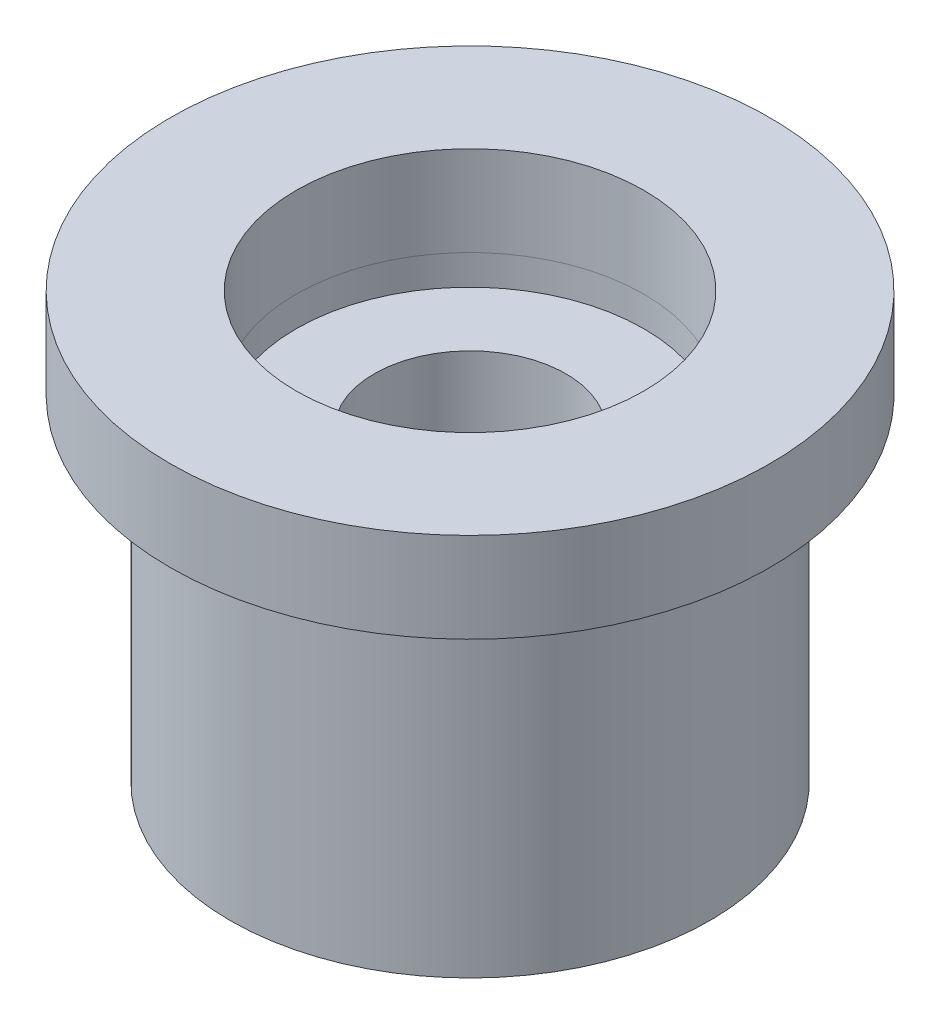
ISO-10303-21;
HEADER;
FILE_DESCRIPTION(('STEP AP214'),'2;1');
FILE_NAME('part.step','',(''),(''),'','','');
FILE_SCHEMA(('AUTOMOTIVE_DESIGN { 1 0 10303 214 1 1 1 1 }'));
ENDSEC;
DATA;
#1=APPLICATION_CONTEXT('core data for automotive mechanical design processes');
#2=APPLICATION_PROTOCOL_DEFINITION('international standard','automotive_design',2000,#1);
#3=PRODUCT_CONTEXT('',#1,'mechanical');
#4=PRODUCT('Part','Part','',(#3));
#5=PRODUCT_RELATED_PRODUCT_CATEGORY('part','',(#4));
#6=PRODUCT_DEFINITION_FORMATION('','',#4);
#7=PRODUCT_DEFINITION_CONTEXT('part definition',#1,'design');
#8=PRODUCT_DEFINITION('design','',#6,#7);
#9=PRODUCT_DEFINITION_SHAPE('','',#8);
#10=(LENGTH_UNIT() NAMED_UNIT(*) SI_UNIT(.MILLI.,.METRE.));
#11=(NAMED_UNIT(*) PLANE_ANGLE_UNIT() SI_UNIT($,.RADIAN.));
#12=(NAMED_UNIT(*) SI_UNIT($,.STERADIAN.) SOLID_ANGLE_UNIT());
#13=UNCERTAINTY_MEASURE_WITH_UNIT(LENGTH_MEASURE(1.E-05),#10,'distance_accuracy_value','');
#14=(GEOMETRIC_REPRESENTATION_CONTEXT(3) GLOBAL_UNCERTAINTY_ASSIGNED_CONTEXT((#13)) GLOBAL_UNIT_ASSIGNED_CONTEXT((#10,
#11,#12)) REPRESENTATION_CONTEXT('',''));
#15=CARTESIAN_POINT('',(0.,0.,0.));
#16=DIRECTION('',(0.,0.,1.));
#17=DIRECTION('',(1.,0.,0.));
#18=AXIS2_PLACEMENT_3D('',#15,#16,#17);
#19=CARTESIAN_POINT('',(0.,7.1,0.));
#20=DIRECTION('',(0.,-1.,0.));
#21=DIRECTION('',(0.,0.,-1.));
#22=AXIS2_PLACEMENT_3D('',#19,#20,#21);
#23=CYLINDRICAL_SURFACE('',#22,5.);
#24=CARTESIAN_POINT('',(0.,7.1,0.));
#25=DIRECTION('',(0.,1.,0.));
#26=DIRECTION('',(0.,0.,1.));
#27=AXIS2_PLACEMENT_3D('',#24,#25,#26);
#28=CIRCLE('',#27,5.);
#29=CARTESIAN_POINT('',(0.,7.1,5.));
#30=VERTEX_POINT('',#29);
#31=EDGE_CURVE('E11',#30,#30,#28,.T.);
#32=ORIENTED_EDGE('',*,*,#31,.F.);
#33=EDGE_LOOP('',(#32));
#34=FACE_BOUND('',#33,.T.);
#35=CARTESIAN_POINT('',(0.,5.6,0.));
#36=DIRECTION('',(0.,1.,0.));
#37=DIRECTION('',(0.,0.,1.));
#38=AXIS2_PLACEMENT_3D('',#35,#36,#37);
#39=CIRCLE('',#38,5.);
#40=CARTESIAN_POINT('',(0.,5.6,5.));
#41=VERTEX_POINT('',#40);
#42=EDGE_CURVE('E50',#41,#41,#39,.T.);
#43=ORIENTED_EDGE('',*,*,#42,.T.);
#44=EDGE_LOOP('',(#43));
#45=FACE_BOUND('',#44,.T.);
#46=ADVANCED_FACE('F43',(#34,#45),#23,.T.);
#47=CARTESIAN_POINT('',(0.,7.1,0.));
#48=DIRECTION('',(0.,1.,0.));
#49=DIRECTION('',(0.,0.,1.));
#50=AXIS2_PLACEMENT_3D('',#47,#48,#49);
#51=PLANE('',#50);
#52=CARTESIAN_POINT('',(0.,7.1,0.));
#53=DIRECTION('',(0.,1.,0.));
#54=DIRECTION('',(0.,0.,1.));
#55=AXIS2_PLACEMENT_3D('',#52,#53,#54);
#56=CIRCLE('',#55,2.9);
#57=CARTESIAN_POINT('',(0.,7.1,2.9));
#58=VERTEX_POINT('',#57);
#59=EDGE_CURVE('E56',#58,#58,#56,.T.);
#60=ORIENTED_EDGE('',*,*,#59,.F.);
#61=EDGE_LOOP('',(#60));
#62=FACE_BOUND('',#61,.T.);
#63=ORIENTED_EDGE('',*,*,#31,.T.);
#64=EDGE_LOOP('',(#63));
#65=FACE_BOUND('',#64,.T.);
#66=ADVANCED_FACE('F72',(#62,#65),#51,.T.);
#67=CARTESIAN_POINT('',(0.,5.6,0.));
#68=DIRECTION('',(0.,1.,0.));
#69=DIRECTION('',(0.,0.,1.));
#70=AXIS2_PLACEMENT_3D('',#67,#68,#69);
#71=PLANE('',#70);
#72=CARTESIAN_POINT('',(0.,5.6,0.));
#73=DIRECTION('',(0.,1.,0.));
#74=DIRECTION('',(0.,0.,1.));
#75=AXIS2_PLACEMENT_3D('',#72,#73,#74);
#76=CIRCLE('',#75,2.9);
#77=CARTESIAN_POINT('',(0.,5.6,2.9));
#78=VERTEX_POINT('',#77);
#79=EDGE_CURVE('E46',#78,#78,#76,.T.);
#80=ORIENTED_EDGE('',*,*,#79,.T.);
#81=EDGE_LOOP('',(#80));
#82=FACE_BOUND('',#81,.T.);
#83=ORIENTED_EDGE('',*,*,#42,.F.);
#84=EDGE_LOOP('',(#83));
#85=FACE_BOUND('',#84,.T.);
#86=ADVANCED_FACE('F63',(#82,#85),#71,.F.);
#87=CARTESIAN_POINT('',(0.,5.1,0.));
#88=DIRECTION('',(0.,1.,0.));
#89=DIRECTION('',(0.,0.,1.));
#90=AXIS2_PLACEMENT_3D('',#87,#88,#89);
#91=CYLINDRICAL_SURFACE('',#90,2.9);
#92=ORIENTED_EDGE('',*,*,#59,.T.);
#93=EDGE_LOOP('',(#92));
#94=FACE_BOUND('',#93,.T.);
#95=ORIENTED_EDGE('',*,*,#79,.F.);
#96=EDGE_LOOP('',(#95));
#97=FACE_BOUND('',#96,.T.);
#98=ADVANCED_FACE('F66',(#94,#97),#91,.F.);
#99=CLOSED_SHELL('',(#46,#66,#86,#98));
#100=MANIFOLD_SOLID_BREP('B2',#99);
#101=CARTESIAN_POINT('',(0.,5.6,0.));
#102=DIRECTION('',(0.,-1.,0.));
#103=DIRECTION('',(0.,0.,-1.));
#104=AXIS2_PLACEMENT_3D('',#101,#102,#103);
#105=CYLINDRICAL_SURFACE('',#104,4.);
#106=CARTESIAN_POINT('',(0.,5.6,0.));
#107=DIRECTION('',(0.,1.,0.));
#108=DIRECTION('',(0.,0.,1.));
#109=AXIS2_PLACEMENT_3D('',#106,#107,#108);
#110=CIRCLE('',#109,4.);
#111=CARTESIAN_POINT('',(0.,5.6,4.));
#112=VERTEX_POINT('',#111);
#113=EDGE_CURVE('E41',#112,#112,#110,.T.);
#114=ORIENTED_EDGE('',*,*,#113,.F.);
#115=EDGE_LOOP('',(#114));
#116=FACE_BOUND('',#115,.T.);
#117=CARTESIAN_POINT('',(0.,0.,0.));
#118=DIRECTION('',(0.,1.,0.));
#119=DIRECTION('',(0.,0.,1.));
#120=AXIS2_PLACEMENT_3D('',#117,#118,#119);
#121=CIRCLE('',#120,4.);
#122=CARTESIAN_POINT('',(0.,0.,4.));
#123=VERTEX_POINT('',#122);
#124=EDGE_CURVE('E113',#123,#123,#121,.T.);
#125=ORIENTED_EDGE('',*,*,#124,.T.);
#126=EDGE_LOOP('',(#125));
#127=FACE_BOUND('',#126,.T.);
#128=ADVANCED_FACE('F105',(#116,#127),#105,.T.);
#129=CARTESIAN_POINT('',(0.,5.6,0.));
#130=DIRECTION('',(0.,1.,0.));
#131=DIRECTION('',(0.,0.,1.));
#132=AXIS2_PLACEMENT_3D('',#129,#130,#131);
#133=PLANE('',#132);
#134=CARTESIAN_POINT('',(0.,5.6,0.));
#135=DIRECTION('',(0.,1.,0.));
#136=DIRECTION('',(0.,0.,1.));
#137=AXIS2_PLACEMENT_3D('',#134,#135,#136);
#138=CIRCLE('',#137,2.9);
#139=CARTESIAN_POINT('',(0.,5.6,2.9));
#140=VERTEX_POINT('',#139);
#141=EDGE_CURVE('E108',#140,#140,#138,.T.);
#142=ORIENTED_EDGE('',*,*,#141,.F.);
#143=EDGE_LOOP('',(#142));
#144=FACE_BOUND('',#143,.T.);
#145=ORIENTED_EDGE('',*,*,#113,.T.);
#146=EDGE_LOOP('',(#145));
#147=FACE_BOUND('',#146,.T.);
#148=ADVANCED_FACE('F312',(#144,#147),#133,.T.);
#149=CARTESIAN_POINT('',(0.,0.,0.));
#150=DIRECTION('',(0.,1.,0.));
#151=DIRECTION('',(0.,0.,1.));
#152=AXIS2_PLACEMENT_3D('',#149,#150,#151);
#153=PLANE('',#152);
#154=DIRECTION('',(0.499999999999992,0.,-0.866025403784443));
#155=VECTOR('',#154,1.);
#156=CARTESIAN_POINT('',(-0.786065003776817,0.,2.16150452459331));
#157=LINE('',#156,#155);
#158=CARTESIAN_POINT('',(-1.19063245338014,0.,2.86223590239484));
#159=VERTEX_POINT('',#158);
#160=CARTESIAN_POINT('',(-0.786065003776817,0.,2.16150452459331));
#161=VERTEX_POINT('',#160);
#162=EDGE_CURVE('E224',#159,#161,#157,.T.);
#163=ORIENTED_EDGE('',*,*,#162,.F.);
#164=CARTESIAN_POINT('',(0.,0.,0.));
#165=DIRECTION('',(0.,-1.,0.));
#166=DIRECTION('',(0.,0.,-1.));
#167=AXIS2_PLACEMENT_3D('',#164,#165,#166);
#168=CIRCLE('',#167,3.1);
#169=CARTESIAN_POINT('',(3.07408522978788,0.,0.4));
#170=VERTEX_POINT('',#169);
#171=EDGE_CURVE('E121',#170,#159,#168,.T.);
#172=ORIENTED_EDGE('',*,*,#171,.F.);
#173=DIRECTION('',(1.,0.,0.));
#174=VECTOR('',#173,1.);
#175=CARTESIAN_POINT('',(2.26495033058123,0.,0.4));
#176=LINE('',#175,#174);
#177=CARTESIAN_POINT('',(2.26495033058123,0.,0.4));
#178=VERTEX_POINT('',#177);
#179=EDGE_CURVE('E215',#178,#170,#176,.T.);
#180=ORIENTED_EDGE('',*,*,#179,.F.);
#181=CARTESIAN_POINT('',(0.,0.,0.));
#182=DIRECTION('',(0.,1.,0.));
#183=DIRECTION('',(0.,0.,-1.));
#184=AXIS2_PLACEMENT_3D('',#181,#182,#183);
#185=CIRCLE('',#184,2.3);
#186=EDGE_CURVE('E218',#161,#178,#185,.T.);
#187=ORIENTED_EDGE('',*,*,#186,.F.);
#188=EDGE_LOOP('',(#163,#172,#180,#187));
#189=FACE_BOUND('',#188,.T.);
#190=DIRECTION('',(-0.499999999999992,0.,0.866025403784443));
#191=VECTOR('',#190,1.);
#192=CARTESIAN_POINT('',(-1.47888532680437,0.,1.76150452459332));
#193=LINE('',#192,#191);
#194=CARTESIAN_POINT('',(-1.47888532680437,0.,1.76150452459332));
#195=VERTEX_POINT('',#194);
#196=CARTESIAN_POINT('',(-1.88345277640769,0.,2.46223590239485));
#197=VERTEX_POINT('',#196);
#198=EDGE_CURVE('E248',#195,#197,#193,.T.);
#199=ORIENTED_EDGE('',*,*,#198,.F.);
#200=CARTESIAN_POINT('',(0.,0.,0.));
#201=DIRECTION('',(0.,1.,0.));
#202=DIRECTION('',(0.,0.,-1.));
#203=AXIS2_PLACEMENT_3D('',#200,#201,#202);
#204=CIRCLE('',#203,2.3);
#205=CARTESIAN_POINT('',(-1.4788853268044,0.,-1.7615045245933));
#206=VERTEX_POINT('',#205);
#207=EDGE_CURVE('E129',#206,#195,#204,.T.);
#208=ORIENTED_EDGE('',*,*,#207,.F.);
#209=DIRECTION('',(0.500000000000004,0.,0.866025403784436));
#210=VECTOR('',#209,1.);
#211=CARTESIAN_POINT('',(-1.4788853268044,0.,-1.7615045245933));
#212=LINE('',#211,#210);
#213=CARTESIAN_POINT('',(-1.88345277640773,0.,-2.46223590239482));
#214=VERTEX_POINT('',#213);
#215=EDGE_CURVE('E237',#214,#206,#212,.T.);
#216=ORIENTED_EDGE('',*,*,#215,.F.);
#217=CARTESIAN_POINT('',(0.,0.,0.));
#218=DIRECTION('',(0.,-1.,0.));
#219=DIRECTION('',(0.,0.,-1.));
#220=AXIS2_PLACEMENT_3D('',#217,#218,#219);
#221=CIRCLE('',#220,3.1);
#222=EDGE_CURVE('E251',#197,#214,#221,.T.);
#223=ORIENTED_EDGE('',*,*,#222,.F.);
#224=EDGE_LOOP('',(#199,#208,#216,#223));
#225=FACE_BOUND('',#224,.T.);
#226=DIRECTION('',(-0.500000000000004,0.,-0.866025403784436));
#227=VECTOR('',#226,1.);
#228=CARTESIAN_POINT('',(-0.786065003776847,0.,-2.1615045245933));
#229=LINE('',#228,#227);
#230=CARTESIAN_POINT('',(-0.786065003776847,0.,-2.1615045245933));
#231=VERTEX_POINT('',#230);
#232=CARTESIAN_POINT('',(-1.19063245338018,0.,-2.86223590239482));
#233=VERTEX_POINT('',#232);
#234=EDGE_CURVE('E279',#231,#233,#229,.T.);
#235=ORIENTED_EDGE('',*,*,#234,.F.);
#236=CARTESIAN_POINT('',(0.,0.,0.));
#237=DIRECTION('',(0.,1.,0.));
#238=DIRECTION('',(0.,0.,-1.));
#239=AXIS2_PLACEMENT_3D('',#236,#237,#238);
#240=CIRCLE('',#239,2.3);
#241=CARTESIAN_POINT('',(2.26495033058123,0.,-0.4));
#242=VERTEX_POINT('',#241);
#243=EDGE_CURVE('E258',#242,#231,#240,.T.);
#244=ORIENTED_EDGE('',*,*,#243,.F.);
#245=DIRECTION('',(-1.,0.,0.));
#246=VECTOR('',#245,1.);
#247=CARTESIAN_POINT('',(2.26495033058123,0.,-0.4));
#248=LINE('',#247,#246);
#249=CARTESIAN_POINT('',(3.07408522978788,0.,-0.4));
#250=VERTEX_POINT('',#249);
#251=EDGE_CURVE('E268',#250,#242,#248,.T.);
#252=ORIENTED_EDGE('',*,*,#251,.F.);
#253=CARTESIAN_POINT('',(0.,0.,0.));
#254=DIRECTION('',(0.,-1.,0.));
#255=DIRECTION('',(0.,0.,-1.));
#256=AXIS2_PLACEMENT_3D('',#253,#254,#255);
#257=CIRCLE('',#256,3.1);
#258=EDGE_CURVE('E282',#233,#250,#257,.T.);
#259=ORIENTED_EDGE('',*,*,#258,.F.);
#260=EDGE_LOOP('',(#235,#244,#252,#259));
#261=FACE_BOUND('',#260,.T.);
#262=CARTESIAN_POINT('',(0.,0.,0.));
#263=DIRECTION('',(0.,1.,0.));
#264=DIRECTION('',(0.,0.,1.));
#265=AXIS2_PLACEMENT_3D('',#262,#263,#264);
#266=CIRCLE('',#265,1.6);
#267=CARTESIAN_POINT('',(0.,0.,1.6));
#268=VERTEX_POINT('',#267);
#269=EDGE_CURVE('E296',#268,#268,#266,.T.);
#270=ORIENTED_EDGE('',*,*,#269,.T.);
#271=EDGE_LOOP('',(#270));
#272=FACE_BOUND('',#271,.T.);
#273=ORIENTED_EDGE('',*,*,#124,.F.);
#274=EDGE_LOOP('',(#273));
#275=FACE_BOUND('',#274,.T.);
#276=ADVANCED_FACE('F315',(#189,#225,#261,#272,#275),#153,.F.);
#277=CARTESIAN_POINT('',(0.,5.1,0.));
#278=DIRECTION('',(0.,1.,0.));
#279=DIRECTION('',(0.,0.,1.));
#280=AXIS2_PLACEMENT_3D('',#277,#278,#279);
#281=CYLINDRICAL_SURFACE('',#280,2.9);
#282=ORIENTED_EDGE('',*,*,#141,.T.);
#283=EDGE_LOOP('',(#282));
#284=FACE_BOUND('',#283,.T.);
#285=CARTESIAN_POINT('',(0.,5.1,0.));
#286=DIRECTION('',(0.,1.,0.));
#287=DIRECTION('',(0.,0.,1.));
#288=AXIS2_PLACEMENT_3D('',#285,#286,#287);
#289=CIRCLE('',#288,2.9);
#290=CARTESIAN_POINT('',(0.,5.1,2.9));
#291=VERTEX_POINT('',#290);
#292=EDGE_CURVE('E299',#291,#291,#289,.T.);
#293=ORIENTED_EDGE('',*,*,#292,.F.);
#294=EDGE_LOOP('',(#293));
#295=FACE_BOUND('',#294,.T.);
#296=ADVANCED_FACE('F309',(#284,#295),#281,.F.);
#297=CARTESIAN_POINT('',(0.,5.1,0.));
#298=DIRECTION('',(0.,1.,0.));
#299=DIRECTION('',(0.,0.,1.));
#300=AXIS2_PLACEMENT_3D('',#297,#298,#299);
#301=PLANE('',#300);
#302=CARTESIAN_POINT('',(0.,5.1,0.));
#303=DIRECTION('',(0.,1.,0.));
#304=DIRECTION('',(0.,0.,1.));
#305=AXIS2_PLACEMENT_3D('',#302,#303,#304);
#306=CIRCLE('',#305,1.6);
#307=CARTESIAN_POINT('',(0.,5.1,1.6));
#308=VERTEX_POINT('',#307);
#309=EDGE_CURVE('E289',#308,#308,#306,.T.);
#310=ORIENTED_EDGE('',*,*,#309,.F.);
#311=EDGE_LOOP('',(#310));
#312=FACE_BOUND('',#311,.T.);
#313=ORIENTED_EDGE('',*,*,#292,.T.);
#314=EDGE_LOOP('',(#313));
#315=FACE_BOUND('',#314,.T.);
#316=ADVANCED_FACE('F340',(#312,#315),#301,.T.);
#317=CARTESIAN_POINT('',(0.,0.,0.));
#318=DIRECTION('',(0.,1.,0.));
#319=DIRECTION('',(0.,0.,1.));
#320=AXIS2_PLACEMENT_3D('',#317,#318,#319);
#321=CYLINDRICAL_SURFACE('',#320,1.6);
#322=ORIENTED_EDGE('',*,*,#269,.F.);
#323=EDGE_LOOP('',(#322));
#324=FACE_BOUND('',#323,.T.);
#325=ORIENTED_EDGE('',*,*,#309,.T.);
#326=EDGE_LOOP('',(#325));
#327=FACE_BOUND('',#326,.T.);
#328=ADVANCED_FACE('F347',(#324,#327),#321,.F.);
#329=CARTESIAN_POINT('',(0.,4.3,0.));
#330=DIRECTION('',(0.,-1.,0.));
#331=DIRECTION('',(0.,0.,-1.));
#332=AXIS2_PLACEMENT_3D('',#329,#330,#331);
#333=CYLINDRICAL_SURFACE('',#332,2.3);
#334=ORIENTED_EDGE('',*,*,#243,.T.);
#335=DIRECTION('',(0.,-1.,0.));
#336=VECTOR('',#335,1.);
#337=CARTESIAN_POINT('',(-0.786065003776847,4.3,-2.1615045245933));
#338=LINE('',#337,#336);
#339=CARTESIAN_POINT('',(-0.786065003776847,4.3,-2.1615045245933));
#340=VERTEX_POINT('',#339);
#341=EDGE_CURVE('E277',#340,#231,#338,.T.);
#342=ORIENTED_EDGE('',*,*,#341,.F.);
#343=CARTESIAN_POINT('',(0.,4.3,0.));
#344=DIRECTION('',(0.,1.,0.));
#345=DIRECTION('',(0.,0.,-1.));
#346=AXIS2_PLACEMENT_3D('',#343,#344,#345);
#347=CIRCLE('',#346,2.3);
#348=CARTESIAN_POINT('',(2.26495033058123,4.3,-0.4));
#349=VERTEX_POINT('',#348);
#350=EDGE_CURVE('E264',#349,#340,#347,.T.);
#351=ORIENTED_EDGE('',*,*,#350,.F.);
#352=DIRECTION('',(0.,-1.,0.));
#353=VECTOR('',#352,1.);
#354=CARTESIAN_POINT('',(2.26495033058123,4.3,-0.4));
#355=LINE('',#354,#353);
#356=EDGE_CURVE('E287',#349,#242,#355,.T.);
#357=ORIENTED_EDGE('',*,*,#356,.T.);
#358=EDGE_LOOP('',(#334,#342,#351,#357));
#359=FACE_BOUND('',#358,.T.);
#360=ADVANCED_FACE('F354',(#359),#333,.T.);
#361=CARTESIAN_POINT('',(2.26495033058123,4.3,-0.4));
#362=DIRECTION('',(0.,0.,1.));
#363=DIRECTION('',(1.,0.,0.));
#364=AXIS2_PLACEMENT_3D('',#361,#362,#363);
#365=PLANE('',#364);
#366=ORIENTED_EDGE('',*,*,#251,.T.);
#367=ORIENTED_EDGE('',*,*,#356,.F.);
#368=DIRECTION('',(-1.,0.,0.));
#369=VECTOR('',#368,1.);
#370=CARTESIAN_POINT('',(2.26495033058123,4.3,-0.4));
#371=LINE('',#370,#369);
#372=CARTESIAN_POINT('',(3.07408522978788,4.3,-0.4));
#373=VERTEX_POINT('',#372);
#374=EDGE_CURVE('E274',#373,#349,#371,.T.);
#375=ORIENTED_EDGE('',*,*,#374,.F.);
#376=DIRECTION('',(0.,-1.,0.));
#377=VECTOR('',#376,1.);
#378=CARTESIAN_POINT('',(3.07408522978788,4.3,-0.4));
#379=LINE('',#378,#377);
#380=EDGE_CURVE('E290',#373,#250,#379,.T.);
#381=ORIENTED_EDGE('',*,*,#380,.T.);
#382=EDGE_LOOP('',(#366,#367,#375,#381));
#383=FACE_BOUND('',#382,.T.);
#384=ADVANCED_FACE('F361',(#383),#365,.F.);
#385=CARTESIAN_POINT('',(0.,4.3,0.));
#386=DIRECTION('',(0.,-1.,0.));
#387=DIRECTION('',(0.,0.,-1.));
#388=AXIS2_PLACEMENT_3D('',#385,#386,#387);
#389=CYLINDRICAL_SURFACE('',#388,3.1);
#390=ORIENTED_EDGE('',*,*,#258,.T.);
#391=ORIENTED_EDGE('',*,*,#380,.F.);
#392=CARTESIAN_POINT('',(0.,4.3,0.));
#393=DIRECTION('',(0.,-1.,0.));
#394=DIRECTION('',(0.,0.,-1.));
#395=AXIS2_PLACEMENT_3D('',#392,#393,#394);
#396=CIRCLE('',#395,3.1);
#397=CARTESIAN_POINT('',(-1.19063245338018,4.3,-2.86223590239482));
#398=VERTEX_POINT('',#397);
#399=EDGE_CURVE('E271',#398,#373,#396,.T.);
#400=ORIENTED_EDGE('',*,*,#399,.F.);
#401=DIRECTION('',(0.,-1.,0.));
#402=VECTOR('',#401,1.);
#403=CARTESIAN_POINT('',(-1.19063245338018,4.3,-2.86223590239482));
#404=LINE('',#403,#402);
#405=EDGE_CURVE('E292',#398,#233,#404,.T.);
#406=ORIENTED_EDGE('',*,*,#405,.T.);
#407=EDGE_LOOP('',(#390,#391,#400,#406));
#408=FACE_BOUND('',#407,.T.);
#409=ADVANCED_FACE('F369',(#408),#389,.F.);
#410=CARTESIAN_POINT('',(-0.786065003776847,4.3,-2.1615045245933));
#411=DIRECTION('',(-0.866025403784436,0.,0.500000000000004));
#412=DIRECTION('',(0.500000000000004,0.,0.866025403784436));
#413=AXIS2_PLACEMENT_3D('',#410,#411,#412);
#414=PLANE('',#413);
#415=ORIENTED_EDGE('',*,*,#234,.T.);
#416=ORIENTED_EDGE('',*,*,#405,.F.);
#417=DIRECTION('',(-0.500000000000004,0.,-0.866025403784436));
#418=VECTOR('',#417,1.);
#419=CARTESIAN_POINT('',(-0.786065003776847,4.3,-2.1615045245933));
#420=LINE('',#419,#418);
#421=EDGE_CURVE('E267',#340,#398,#420,.T.);
#422=ORIENTED_EDGE('',*,*,#421,.F.);
#423=ORIENTED_EDGE('',*,*,#341,.T.);
#424=EDGE_LOOP('',(#415,#416,#422,#423));
#425=FACE_BOUND('',#424,.T.);
#426=ADVANCED_FACE('F377',(#425),#414,.F.);
#427=CARTESIAN_POINT('',(0.,4.3,0.));
#428=DIRECTION('',(0.,-1.,0.));
#429=DIRECTION('',(0.,0.,-1.));
#430=AXIS2_PLACEMENT_3D('',#427,#428,#429);
#431=PLANE('',#430);
#432=ORIENTED_EDGE('',*,*,#350,.T.);
#433=ORIENTED_EDGE('',*,*,#421,.T.);
#434=ORIENTED_EDGE('',*,*,#399,.T.);
#435=ORIENTED_EDGE('',*,*,#374,.T.);
#436=EDGE_LOOP('',(#432,#433,#434,#435));
#437=FACE_BOUND('',#436,.T.);
#438=ADVANCED_FACE('F385',(#437),#431,.T.);
#439=CARTESIAN_POINT('',(0.,4.3,0.));
#440=DIRECTION('',(0.,-1.,0.));
#441=DIRECTION('',(0.,0.,-1.));
#442=AXIS2_PLACEMENT_3D('',#439,#440,#441);
#443=CYLINDRICAL_SURFACE('',#442,2.3);
#444=ORIENTED_EDGE('',*,*,#207,.T.);
#445=DIRECTION('',(0.,-1.,0.));
#446=VECTOR('',#445,1.);
#447=CARTESIAN_POINT('',(-1.47888532680437,4.3,1.76150452459332));
#448=LINE('',#447,#446);
#449=CARTESIAN_POINT('',(-1.47888532680437,4.3,1.76150452459332));
#450=VERTEX_POINT('',#449);
#451=EDGE_CURVE('E246',#450,#195,#448,.T.);
#452=ORIENTED_EDGE('',*,*,#451,.F.);
#453=CARTESIAN_POINT('',(0.,4.3,0.));
#454=DIRECTION('',(0.,1.,0.));
#455=DIRECTION('',(0.,0.,-1.));
#456=AXIS2_PLACEMENT_3D('',#453,#454,#455);
#457=CIRCLE('',#456,2.3);
#458=CARTESIAN_POINT('',(-1.4788853268044,4.3,-1.7615045245933));
#459=VERTEX_POINT('',#458);
#460=EDGE_CURVE('E233',#459,#450,#457,.T.);
#461=ORIENTED_EDGE('',*,*,#460,.F.);
#462=DIRECTION('',(0.,-1.,0.));
#463=VECTOR('',#462,1.);
#464=CARTESIAN_POINT('',(-1.4788853268044,4.3,-1.7615045245933));
#465=LINE('',#464,#463);
#466=EDGE_CURVE('E256',#459,#206,#465,.T.);
#467=ORIENTED_EDGE('',*,*,#466,.T.);
#468=EDGE_LOOP('',(#444,#452,#461,#467));
#469=FACE_BOUND('',#468,.T.);
#470=ADVANCED_FACE('F393',(#469),#443,.T.);
#471=CARTESIAN_POINT('',(-1.4788853268044,4.3,-1.7615045245933));
#472=DIRECTION('',(0.866025403784436,0.,-0.500000000000004));
#473=DIRECTION('',(-0.500000000000004,0.,-0.866025403784436));
#474=AXIS2_PLACEMENT_3D('',#471,#472,#473);
#475=PLANE('',#474);
#476=ORIENTED_EDGE('',*,*,#215,.T.);
#477=ORIENTED_EDGE('',*,*,#466,.F.);
#478=DIRECTION('',(0.500000000000004,0.,0.866025403784436));
#479=VECTOR('',#478,1.);
#480=CARTESIAN_POINT('',(-1.4788853268044,4.3,-1.7615045245933));
#481=LINE('',#480,#479);
#482=CARTESIAN_POINT('',(-1.88345277640773,4.3,-2.46223590239482));
#483=VERTEX_POINT('',#482);
#484=EDGE_CURVE('E243',#483,#459,#481,.T.);
#485=ORIENTED_EDGE('',*,*,#484,.F.);
#486=DIRECTION('',(0.,-1.,0.));
#487=VECTOR('',#486,1.);
#488=CARTESIAN_POINT('',(-1.88345277640773,4.3,-2.46223590239482));
#489=LINE('',#488,#487);
#490=EDGE_CURVE('E259',#483,#214,#489,.T.);
#491=ORIENTED_EDGE('',*,*,#490,.T.);
#492=EDGE_LOOP('',(#476,#477,#485,#491));
#493=FACE_BOUND('',#492,.T.);
#494=ADVANCED_FACE('F401',(#493),#475,.F.);
#495=CARTESIAN_POINT('',(0.,4.3,0.));
#496=DIRECTION('',(0.,-1.,0.));
#497=DIRECTION('',(0.,0.,-1.));
#498=AXIS2_PLACEMENT_3D('',#495,#496,#497);
#499=CYLINDRICAL_SURFACE('',#498,3.1);
#500=ORIENTED_EDGE('',*,*,#222,.T.);
#501=ORIENTED_EDGE('',*,*,#490,.F.);
#502=CARTESIAN_POINT('',(0.,4.3,0.));
#503=DIRECTION('',(0.,-1.,0.));
#504=DIRECTION('',(0.,0.,-1.));
#505=AXIS2_PLACEMENT_3D('',#502,#503,#504);
#506=CIRCLE('',#505,3.1);
#507=CARTESIAN_POINT('',(-1.88345277640769,4.3,2.46223590239485));
#508=VERTEX_POINT('',#507);
#509=EDGE_CURVE('E240',#508,#483,#506,.T.);
#510=ORIENTED_EDGE('',*,*,#509,.F.);
#511=DIRECTION('',(0.,-1.,0.));
#512=VECTOR('',#511,1.);
#513=CARTESIAN_POINT('',(-1.88345277640769,4.3,2.46223590239485));
#514=LINE('',#513,#512);
#515=EDGE_CURVE('E261',#508,#197,#514,.T.);
#516=ORIENTED_EDGE('',*,*,#515,.T.);
#517=EDGE_LOOP('',(#500,#501,#510,#516));
#518=FACE_BOUND('',#517,.T.);
#519=ADVANCED_FACE('F408',(#518),#499,.F.);
#520=CARTESIAN_POINT('',(-1.47888532680437,4.3,1.76150452459332));
#521=DIRECTION('',(0.866025403784443,0.,0.499999999999992));
#522=DIRECTION('',(0.499999999999992,0.,-0.866025403784443));
#523=AXIS2_PLACEMENT_3D('',#520,#521,#522);
#524=PLANE('',#523);
#525=ORIENTED_EDGE('',*,*,#198,.T.);
#526=ORIENTED_EDGE('',*,*,#515,.F.);
#527=DIRECTION('',(-0.499999999999992,0.,0.866025403784443));
#528=VECTOR('',#527,1.);
#529=CARTESIAN_POINT('',(-1.47888532680437,4.3,1.76150452459332));
#530=LINE('',#529,#528);
#531=EDGE_CURVE('E236',#450,#508,#530,.T.);
#532=ORIENTED_EDGE('',*,*,#531,.F.);
#533=ORIENTED_EDGE('',*,*,#451,.T.);
#534=EDGE_LOOP('',(#525,#526,#532,#533));
#535=FACE_BOUND('',#534,.T.);
#536=ADVANCED_FACE('F416',(#535),#524,.F.);
#537=CARTESIAN_POINT('',(0.,4.3,0.));
#538=DIRECTION('',(0.,-1.,0.));
#539=DIRECTION('',(0.,0.,-1.));
#540=AXIS2_PLACEMENT_3D('',#537,#538,#539);
#541=PLANE('',#540);
#542=ORIENTED_EDGE('',*,*,#460,.T.);
#543=ORIENTED_EDGE('',*,*,#531,.T.);
#544=ORIENTED_EDGE('',*,*,#509,.T.);
#545=ORIENTED_EDGE('',*,*,#484,.T.);
#546=EDGE_LOOP('',(#542,#543,#544,#545));
#547=FACE_BOUND('',#546,.T.);
#548=ADVANCED_FACE('F424',(#547),#541,.T.);
#549=CARTESIAN_POINT('',(0.,4.3,0.));
#550=DIRECTION('',(0.,-1.,0.));
#551=DIRECTION('',(0.,0.,-1.));
#552=AXIS2_PLACEMENT_3D('',#549,#550,#551);
#553=CYLINDRICAL_SURFACE('',#552,3.1);
#554=ORIENTED_EDGE('',*,*,#171,.T.);
#555=DIRECTION('',(0.,-1.,0.));
#556=VECTOR('',#555,1.);
#557=CARTESIAN_POINT('',(-1.19063245338014,4.3,2.86223590239484));
#558=LINE('',#557,#556);
#559=CARTESIAN_POINT('',(-1.19063245338014,4.3,2.86223590239484));
#560=VERTEX_POINT('',#559);
#561=EDGE_CURVE('E193',#560,#159,#558,.T.);
#562=ORIENTED_EDGE('',*,*,#561,.F.);
#563=CARTESIAN_POINT('',(0.,4.3,0.));
#564=DIRECTION('',(0.,-1.,0.));
#565=DIRECTION('',(0.,0.,-1.));
#566=AXIS2_PLACEMENT_3D('',#563,#564,#565);
#567=CIRCLE('',#566,3.1);
#568=CARTESIAN_POINT('',(3.07408522978788,4.3,0.4));
#569=VERTEX_POINT('',#568);
#570=EDGE_CURVE('E197',#569,#560,#567,.T.);
#571=ORIENTED_EDGE('',*,*,#570,.F.);
#572=DIRECTION('',(0.,-1.,0.));
#573=VECTOR('',#572,1.);
#574=CARTESIAN_POINT('',(3.07408522978788,4.3,0.4));
#575=LINE('',#574,#573);
#576=EDGE_CURVE('E228',#569,#170,#575,.T.);
#577=ORIENTED_EDGE('',*,*,#576,.T.);
#578=EDGE_LOOP('',(#554,#562,#571,#577));
#579=FACE_BOUND('',#578,.T.);
#580=ADVANCED_FACE('F195',(#579),#553,.F.);
#581=CARTESIAN_POINT('',(2.26495033058123,4.3,0.4));
#582=DIRECTION('',(0.,0.,-1.));
#583=DIRECTION('',(-1.,0.,0.));
#584=AXIS2_PLACEMENT_3D('',#581,#582,#583);
#585=PLANE('',#584);
#586=ORIENTED_EDGE('',*,*,#179,.T.);
#587=ORIENTED_EDGE('',*,*,#576,.F.);
#588=DIRECTION('',(1.,0.,0.));
#589=VECTOR('',#588,1.);
#590=CARTESIAN_POINT('',(2.26495033058123,4.3,0.4));
#591=LINE('',#590,#589);
#592=CARTESIAN_POINT('',(2.26495033058123,4.3,0.4));
#593=VERTEX_POINT('',#592);
#594=EDGE_CURVE('E203',#593,#569,#591,.T.);
#595=ORIENTED_EDGE('',*,*,#594,.F.);
#596=DIRECTION('',(0.,-1.,0.));
#597=VECTOR('',#596,1.);
#598=CARTESIAN_POINT('',(2.26495033058123,4.3,0.4));
#599=LINE('',#598,#597);
#600=EDGE_CURVE('E230',#593,#178,#599,.T.);
#601=ORIENTED_EDGE('',*,*,#600,.T.);
#602=EDGE_LOOP('',(#586,#587,#595,#601));
#603=FACE_BOUND('',#602,.T.);
#604=ADVANCED_FACE('F439',(#603),#585,.F.);
#605=CARTESIAN_POINT('',(0.,4.3,0.));
#606=DIRECTION('',(0.,-1.,0.));
#607=DIRECTION('',(0.,0.,-1.));
#608=AXIS2_PLACEMENT_3D('',#605,#606,#607);
#609=CYLINDRICAL_SURFACE('',#608,2.3);
#610=ORIENTED_EDGE('',*,*,#186,.T.);
#611=ORIENTED_EDGE('',*,*,#600,.F.);
#612=CARTESIAN_POINT('',(0.,4.3,0.));
#613=DIRECTION('',(0.,1.,0.));
#614=DIRECTION('',(0.,0.,-1.));
#615=AXIS2_PLACEMENT_3D('',#612,#613,#614);
#616=CIRCLE('',#615,2.3);
#617=CARTESIAN_POINT('',(-0.786065003776817,4.3,2.16150452459331));
#618=VERTEX_POINT('',#617);
#619=EDGE_CURVE('E211',#618,#593,#616,.T.);
#620=ORIENTED_EDGE('',*,*,#619,.F.);
#621=DIRECTION('',(0.,-1.,0.));
#622=VECTOR('',#621,1.);
#623=CARTESIAN_POINT('',(-0.786065003776817,4.3,2.16150452459331));
#624=LINE('',#623,#622);
#625=EDGE_CURVE('E202',#618,#161,#624,.T.);
#626=ORIENTED_EDGE('',*,*,#625,.T.);
#627=EDGE_LOOP('',(#610,#611,#620,#626));
#628=FACE_BOUND('',#627,.T.);
#629=ADVANCED_FACE('F446',(#628),#609,.T.);
#630=CARTESIAN_POINT('',(-0.786065003776817,4.3,2.16150452459331));
#631=DIRECTION('',(-0.866025403784443,0.,-0.499999999999992));
#632=DIRECTION('',(-0.499999999999992,0.,0.866025403784443));
#633=AXIS2_PLACEMENT_3D('',#630,#631,#632);
#634=PLANE('',#633);
#635=ORIENTED_EDGE('',*,*,#162,.T.);
#636=ORIENTED_EDGE('',*,*,#625,.F.);
#637=DIRECTION('',(0.499999999999992,0.,-0.866025403784443));
#638=VECTOR('',#637,1.);
#639=CARTESIAN_POINT('',(-0.786065003776817,4.3,2.16150452459331));
#640=LINE('',#639,#638);
#641=EDGE_CURVE('E206',#560,#618,#640,.T.);
#642=ORIENTED_EDGE('',*,*,#641,.F.);
#643=ORIENTED_EDGE('',*,*,#561,.T.);
#644=EDGE_LOOP('',(#635,#636,#642,#643));
#645=FACE_BOUND('',#644,.T.);
#646=ADVANCED_FACE('F207',(#645),#634,.F.);
#647=CARTESIAN_POINT('',(0.,4.3,0.));
#648=DIRECTION('',(0.,-1.,0.));
#649=DIRECTION('',(0.,0.,-1.));
#650=AXIS2_PLACEMENT_3D('',#647,#648,#649);
#651=PLANE('',#650);
#652=ORIENTED_EDGE('',*,*,#570,.T.);
#653=ORIENTED_EDGE('',*,*,#641,.T.);
#654=ORIENTED_EDGE('',*,*,#619,.T.);
#655=ORIENTED_EDGE('',*,*,#594,.T.);
#656=EDGE_LOOP('',(#652,#653,#654,#655));
#657=FACE_BOUND('',#656,.T.);
#658=ADVANCED_FACE('F213',(#657),#651,.T.);
#659=CLOSED_SHELL('',(#128,#148,#276,#296,#316,#328,#360,#384,#409,#426,#438,#470,#494,#519,
#536,#548,#580,#604,#629,#646,#658));
#660=MANIFOLD_SOLID_BREP('B6',#659);
#661=ADVANCED_BREP_SHAPE_REPRESENTATION('',(#18,#100,#660),#14);
#662=SHAPE_DEFINITION_REPRESENTATION(#9,#661);
ENDSEC;
END-ISO-10303-21;
